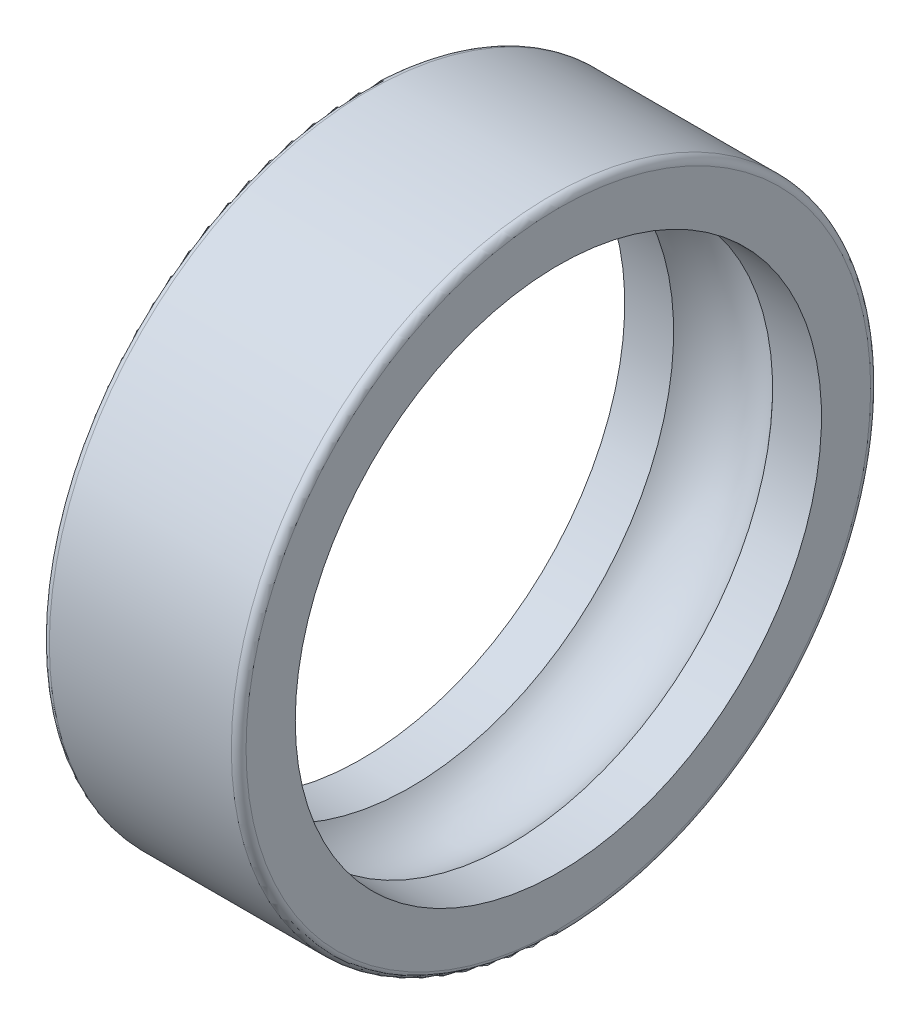
ISO-10303-21;
HEADER;
FILE_DESCRIPTION(('STEP AP214'),'2;1');
FILE_NAME('part.step','',(''),(''),'','','');
FILE_SCHEMA(('AUTOMOTIVE_DESIGN { 1 0 10303 214 1 1 1 1 }'));
ENDSEC;
DATA;
#1=APPLICATION_CONTEXT('core data for automotive mechanical design processes');
#2=APPLICATION_PROTOCOL_DEFINITION('international standard','automotive_design',2000,#1);
#3=PRODUCT_CONTEXT('',#1,'mechanical');
#4=PRODUCT('Part','Part','',(#3));
#5=PRODUCT_RELATED_PRODUCT_CATEGORY('part','',(#4));
#6=PRODUCT_DEFINITION_FORMATION('','',#4);
#7=PRODUCT_DEFINITION_CONTEXT('part definition',#1,'design');
#8=PRODUCT_DEFINITION('design','',#6,#7);
#9=PRODUCT_DEFINITION_SHAPE('','',#8);
#10=(LENGTH_UNIT() NAMED_UNIT(*) SI_UNIT(.MILLI.,.METRE.));
#11=(NAMED_UNIT(*) PLANE_ANGLE_UNIT() SI_UNIT($,.RADIAN.));
#12=(NAMED_UNIT(*) SI_UNIT($,.STERADIAN.) SOLID_ANGLE_UNIT());
#13=UNCERTAINTY_MEASURE_WITH_UNIT(LENGTH_MEASURE(1.E-05),#10,'distance_accuracy_value','');
#14=(GEOMETRIC_REPRESENTATION_CONTEXT(3) GLOBAL_UNCERTAINTY_ASSIGNED_CONTEXT((#13)) GLOBAL_UNIT_ASSIGNED_CONTEXT((#10,
#11,#12)) REPRESENTATION_CONTEXT('',''));
#15=CARTESIAN_POINT('',(0.,0.,0.));
#16=DIRECTION('',(0.,0.,1.));
#17=DIRECTION('',(1.,0.,0.));
#18=AXIS2_PLACEMENT_3D('',#15,#16,#17);
#19=CARTESIAN_POINT('',(0.,12.7,0.));
#20=DIRECTION('',(1.,0.,0.));
#21=DIRECTION('',(0.,0.,-1.));
#22=AXIS2_PLACEMENT_3D('',#19,#20,#21);
#23=PLANE('',#22);
#24=CARTESIAN_POINT('',(0.,0.,0.));
#25=DIRECTION('',(-1.,0.,0.));
#26=DIRECTION('',(0.,0.,1.));
#27=AXIS2_PLACEMENT_3D('',#24,#25,#26);
#28=CIRCLE('',#27,10.7);
#29=CARTESIAN_POINT('',(0.,0.,10.7));
#30=VERTEX_POINT('',#29);
#31=EDGE_CURVE('E10',#30,#30,#28,.T.);
#32=ORIENTED_EDGE('',*,*,#31,.F.);
#33=EDGE_LOOP('',(#32));
#34=FACE_BOUND('',#33,.T.);
#35=CARTESIAN_POINT('',(0.,0.,0.));
#36=DIRECTION('',(-1.,0.,0.));
#37=DIRECTION('',(0.,0.,1.));
#38=AXIS2_PLACEMENT_3D('',#35,#36,#37);
#39=CIRCLE('',#38,12.7);
#40=CARTESIAN_POINT('',(0.,0.,12.7));
#41=VERTEX_POINT('',#40);
#42=EDGE_CURVE('E42',#41,#41,#39,.T.);
#43=ORIENTED_EDGE('',*,*,#42,.T.);
#44=EDGE_LOOP('',(#43));
#45=FACE_BOUND('',#44,.T.);
#46=ADVANCED_FACE('F14',(#34,#45),#23,.F.);
#47=CARTESIAN_POINT('',(0.,0.,0.));
#48=DIRECTION('',(-1.,0.,0.));
#49=DIRECTION('',(0.,0.,1.));
#50=AXIS2_PLACEMENT_3D('',#47,#48,#49);
#51=CYLINDRICAL_SURFACE('',#50,10.7);
#52=CARTESIAN_POINT('',(1.9878839220584,0.,0.));
#53=DIRECTION('',(-1.,0.,0.));
#54=DIRECTION('',(0.,0.,1.));
#55=AXIS2_PLACEMENT_3D('',#52,#53,#54);
#56=CIRCLE('',#55,10.7);
#57=CARTESIAN_POINT('',(1.9878839220584,0.,10.7));
#58=VERTEX_POINT('',#57);
#59=EDGE_CURVE('E20',#58,#58,#56,.T.);
#60=ORIENTED_EDGE('',*,*,#59,.F.);
#61=EDGE_LOOP('',(#60));
#62=FACE_BOUND('',#61,.T.);
#63=ORIENTED_EDGE('',*,*,#31,.T.);
#64=EDGE_LOOP('',(#63));
#65=FACE_BOUND('',#64,.T.);
#66=ADVANCED_FACE('F79',(#62,#65),#51,.F.);
#67=CARTESIAN_POINT('',(4.,0.,0.));
#68=DIRECTION('',(-1.,0.,0.));
#69=DIRECTION('',(0.,0.,1.));
#70=AXIS2_PLACEMENT_3D('',#67,#68,#69);
#71=TOROIDAL_SURFACE('',#70,8.95,2.66666666666666);
#72=ORIENTED_EDGE('',*,*,#59,.T.);
#73=EDGE_LOOP('',(#72));
#74=FACE_BOUND('',#73,.T.);
#75=CARTESIAN_POINT('',(6.01211607794161,0.,0.));
#76=DIRECTION('',(-1.,0.,0.));
#77=DIRECTION('',(0.,0.,1.));
#78=AXIS2_PLACEMENT_3D('',#75,#76,#77);
#79=CIRCLE('',#78,10.7);
#80=CARTESIAN_POINT('',(6.01211607794161,0.,10.7));
#81=VERTEX_POINT('',#80);
#82=EDGE_CURVE('E24',#81,#81,#79,.T.);
#83=ORIENTED_EDGE('',*,*,#82,.F.);
#84=EDGE_LOOP('',(#83));
#85=FACE_BOUND('',#84,.T.);
#86=ADVANCED_FACE('F74',(#74,#85),#71,.F.);
#87=CARTESIAN_POINT('',(0.,0.,0.));
#88=DIRECTION('',(-1.,0.,0.));
#89=DIRECTION('',(0.,0.,1.));
#90=AXIS2_PLACEMENT_3D('',#87,#88,#89);
#91=CYLINDRICAL_SURFACE('',#90,10.7);
#92=CARTESIAN_POINT('',(8.,0.,0.));
#93=DIRECTION('',(-1.,0.,0.));
#94=DIRECTION('',(0.,0.,1.));
#95=AXIS2_PLACEMENT_3D('',#92,#93,#94);
#96=CIRCLE('',#95,10.7);
#97=CARTESIAN_POINT('',(8.,0.,10.7));
#98=VERTEX_POINT('',#97);
#99=EDGE_CURVE('E28',#98,#98,#96,.T.);
#100=ORIENTED_EDGE('',*,*,#99,.F.);
#101=EDGE_LOOP('',(#100));
#102=FACE_BOUND('',#101,.T.);
#103=ORIENTED_EDGE('',*,*,#82,.T.);
#104=EDGE_LOOP('',(#103));
#105=FACE_BOUND('',#104,.T.);
#106=ADVANCED_FACE('F68',(#102,#105),#91,.F.);
#107=CARTESIAN_POINT('',(8.,10.7,0.));
#108=DIRECTION('',(-1.,0.,0.));
#109=DIRECTION('',(0.,0.,1.));
#110=AXIS2_PLACEMENT_3D('',#107,#108,#109);
#111=PLANE('',#110);
#112=CARTESIAN_POINT('',(8.,0.,0.));
#113=DIRECTION('',(-1.,0.,0.));
#114=DIRECTION('',(0.,0.,1.));
#115=AXIS2_PLACEMENT_3D('',#112,#113,#114);
#116=CIRCLE('',#115,12.7);
#117=CARTESIAN_POINT('',(8.,0.,12.7));
#118=VERTEX_POINT('',#117);
#119=EDGE_CURVE('E33',#118,#118,#116,.T.);
#120=ORIENTED_EDGE('',*,*,#119,.F.);
#121=EDGE_LOOP('',(#120));
#122=FACE_BOUND('',#121,.T.);
#123=ORIENTED_EDGE('',*,*,#99,.T.);
#124=EDGE_LOOP('',(#123));
#125=FACE_BOUND('',#124,.T.);
#126=ADVANCED_FACE('F62',(#122,#125),#111,.F.);
#127=CARTESIAN_POINT('',(7.7,0.,0.));
#128=DIRECTION('',(-1.,0.,0.));
#129=DIRECTION('',(0.,0.,1.));
#130=AXIS2_PLACEMENT_3D('',#127,#128,#129);
#131=TOROIDAL_SURFACE('',#130,12.7,0.3);
#132=CARTESIAN_POINT('',(7.7,0.,0.));
#133=DIRECTION('',(-1.,0.,0.));
#134=DIRECTION('',(0.,0.,1.));
#135=AXIS2_PLACEMENT_3D('',#132,#133,#134);
#136=CIRCLE('',#135,13.);
#137=CARTESIAN_POINT('',(7.7,0.,13.));
#138=VERTEX_POINT('',#137);
#139=EDGE_CURVE('E36',#138,#138,#136,.T.);
#140=ORIENTED_EDGE('',*,*,#139,.F.);
#141=EDGE_LOOP('',(#140));
#142=FACE_BOUND('',#141,.T.);
#143=ORIENTED_EDGE('',*,*,#119,.T.);
#144=EDGE_LOOP('',(#143));
#145=FACE_BOUND('',#144,.T.);
#146=ADVANCED_FACE('F56',(#142,#145),#131,.T.);
#147=CARTESIAN_POINT('',(0.,0.,0.));
#148=DIRECTION('',(-1.,0.,0.));
#149=DIRECTION('',(0.,0.,1.));
#150=AXIS2_PLACEMENT_3D('',#147,#148,#149);
#151=CYLINDRICAL_SURFACE('',#150,13.);
#152=CARTESIAN_POINT('',(0.300000000000002,0.,0.));
#153=DIRECTION('',(-1.,0.,0.));
#154=DIRECTION('',(0.,0.,1.));
#155=AXIS2_PLACEMENT_3D('',#152,#153,#154);
#156=CIRCLE('',#155,13.);
#157=CARTESIAN_POINT('',(0.300000000000002,0.,13.));
#158=VERTEX_POINT('',#157);
#159=EDGE_CURVE('E39',#158,#158,#156,.T.);
#160=ORIENTED_EDGE('',*,*,#159,.F.);
#161=EDGE_LOOP('',(#160));
#162=FACE_BOUND('',#161,.T.);
#163=ORIENTED_EDGE('',*,*,#139,.T.);
#164=EDGE_LOOP('',(#163));
#165=FACE_BOUND('',#164,.T.);
#166=ADVANCED_FACE('F50',(#162,#165),#151,.T.);
#167=CARTESIAN_POINT('',(0.300000000000002,0.,0.));
#168=DIRECTION('',(-1.,0.,0.));
#169=DIRECTION('',(0.,0.,1.));
#170=AXIS2_PLACEMENT_3D('',#167,#168,#169);
#171=TOROIDAL_SURFACE('',#170,12.7,0.3);
#172=ORIENTED_EDGE('',*,*,#42,.F.);
#173=EDGE_LOOP('',(#172));
#174=FACE_BOUND('',#173,.T.);
#175=ORIENTED_EDGE('',*,*,#159,.T.);
#176=EDGE_LOOP('',(#175));
#177=FACE_BOUND('',#176,.T.);
#178=ADVANCED_FACE('F47',(#174,#177),#171,.T.);
#179=CLOSED_SHELL('',(#46,#66,#86,#106,#126,#146,#166,#178));
#180=MANIFOLD_SOLID_BREP('B1',#179);
#181=ADVANCED_BREP_SHAPE_REPRESENTATION('',(#18,#180),#14);
#182=SHAPE_DEFINITION_REPRESENTATION(#9,#181);
ENDSEC;
END-ISO-10303-21;
